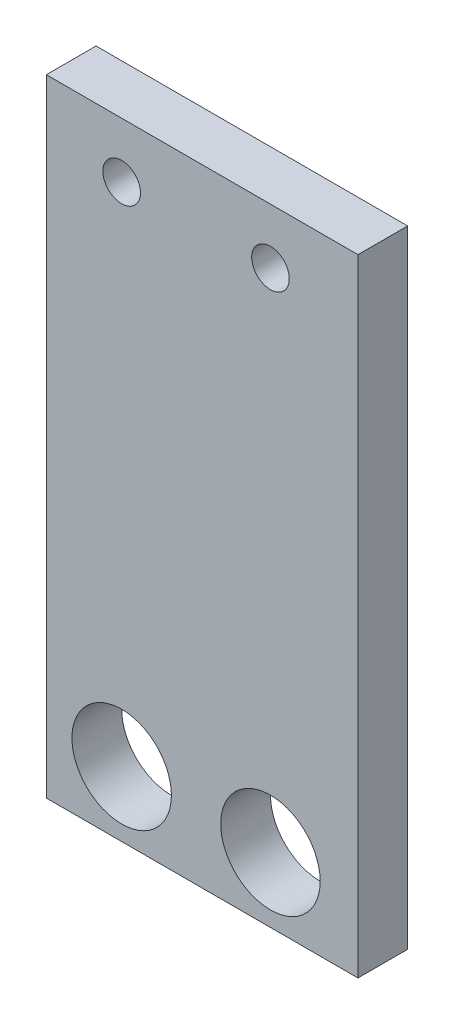
ISO-10303-21;
HEADER;
FILE_DESCRIPTION(('STEP AP214'),'2;1');
FILE_NAME('part.step','',(''),(''),'','','');
FILE_SCHEMA(('AUTOMOTIVE_DESIGN { 1 0 10303 214 1 1 1 1 }'));
ENDSEC;
DATA;
#1=APPLICATION_CONTEXT('core data for automotive mechanical design processes');
#2=APPLICATION_PROTOCOL_DEFINITION('international standard','automotive_design',2000,#1);
#3=PRODUCT_CONTEXT('',#1,'mechanical');
#4=PRODUCT('Part','Part','',(#3));
#5=PRODUCT_RELATED_PRODUCT_CATEGORY('part','',(#4));
#6=PRODUCT_DEFINITION_FORMATION('','',#4);
#7=PRODUCT_DEFINITION_CONTEXT('part definition',#1,'design');
#8=PRODUCT_DEFINITION('design','',#6,#7);
#9=PRODUCT_DEFINITION_SHAPE('','',#8);
#10=(LENGTH_UNIT() NAMED_UNIT(*) SI_UNIT(.MILLI.,.METRE.));
#11=(NAMED_UNIT(*) PLANE_ANGLE_UNIT() SI_UNIT($,.RADIAN.));
#12=(NAMED_UNIT(*) SI_UNIT($,.STERADIAN.) SOLID_ANGLE_UNIT());
#13=UNCERTAINTY_MEASURE_WITH_UNIT(LENGTH_MEASURE(1.E-05),#10,'distance_accuracy_value','');
#14=(GEOMETRIC_REPRESENTATION_CONTEXT(3) GLOBAL_UNCERTAINTY_ASSIGNED_CONTEXT((#13)) GLOBAL_UNIT_ASSIGNED_CONTEXT((#10,
#11,#12)) REPRESENTATION_CONTEXT('',''));
#15=CARTESIAN_POINT('',(0.,0.,0.));
#16=DIRECTION('',(0.,0.,1.));
#17=DIRECTION('',(1.,0.,0.));
#18=AXIS2_PLACEMENT_3D('',#15,#16,#17);
#19=CARTESIAN_POINT('',(0.,0.,3.175));
#20=DIRECTION('',(0.,0.,1.));
#21=DIRECTION('',(1.,0.,0.));
#22=AXIS2_PLACEMENT_3D('',#19,#20,#21);
#23=PLANE('',#22);
#24=CARTESIAN_POINT('',(-4.23397186213208,-20.1517609435873,3.175));
#25=DIRECTION('',(0.,0.,1.));
#26=DIRECTION('',(1.,0.,0.));
#27=AXIS2_PLACEMENT_3D('',#24,#25,#26);
#28=CIRCLE('',#27,3.175);
#29=CARTESIAN_POINT('',(-1.05897186213208,-20.1517609435873,3.175));
#30=VERTEX_POINT('',#29);
#31=EDGE_CURVE('E146',#30,#30,#28,.T.);
#32=ORIENTED_EDGE('',*,*,#31,.F.);
#33=EDGE_LOOP('',(#32));
#34=FACE_BOUND('',#33,.T.);
#35=CARTESIAN_POINT('',(-4.23397186213208,12.1721041198063,3.175));
#36=DIRECTION('',(0.,0.,1.));
#37=DIRECTION('',(1.,0.,0.));
#38=AXIS2_PLACEMENT_3D('',#35,#36,#37);
#39=CIRCLE('',#38,1.2);
#40=CARTESIAN_POINT('',(-3.03397186213208,12.1721041198063,3.175));
#41=VERTEX_POINT('',#40);
#42=EDGE_CURVE('E116',#41,#41,#39,.T.);
#43=ORIENTED_EDGE('',*,*,#42,.F.);
#44=EDGE_LOOP('',(#43));
#45=FACE_BOUND('',#44,.T.);
#46=DIRECTION('',(0.,-1.,0.));
#47=VECTOR('',#46,1.);
#48=CARTESIAN_POINT('',(-9.04597186213208,15.7037616287937,3.175));
#49=LINE('',#48,#47);
#50=CARTESIAN_POINT('',(-9.04597186213208,15.7037616287937,3.175));
#51=VERTEX_POINT('',#50);
#52=CARTESIAN_POINT('',(-9.04597186213208,-24.2962383712063,3.175));
#53=VERTEX_POINT('',#52);
#54=EDGE_CURVE('E96',#51,#53,#49,.T.);
#55=ORIENTED_EDGE('',*,*,#54,.T.);
#56=DIRECTION('',(1.,0.,0.));
#57=VECTOR('',#56,1.);
#58=CARTESIAN_POINT('',(-9.04597186213208,-24.2962383712063,3.175));
#59=LINE('',#58,#57);
#60=CARTESIAN_POINT('',(10.8540281378679,-24.2962383712063,3.175));
#61=VERTEX_POINT('',#60);
#62=EDGE_CURVE('E91',#53,#61,#59,.T.);
#63=ORIENTED_EDGE('',*,*,#62,.T.);
#64=DIRECTION('',(0.,1.,0.));
#65=VECTOR('',#64,1.);
#66=CARTESIAN_POINT('',(10.8540281378679,15.7037616287937,3.175));
#67=LINE('',#66,#65);
#68=CARTESIAN_POINT('',(10.8540281378679,15.7037616287937,3.175));
#69=VERTEX_POINT('',#68);
#70=EDGE_CURVE('E94',#61,#69,#67,.T.);
#71=ORIENTED_EDGE('',*,*,#70,.T.);
#72=DIRECTION('',(-1.,0.,0.));
#73=VECTOR('',#72,1.);
#74=CARTESIAN_POINT('',(-9.04597186213208,15.7037616287937,3.175));
#75=LINE('',#74,#73);
#76=EDGE_CURVE('E61',#69,#51,#75,.T.);
#77=ORIENTED_EDGE('',*,*,#76,.T.);
#78=EDGE_LOOP('',(#55,#63,#71,#77));
#79=FACE_BOUND('',#78,.T.);
#80=CARTESIAN_POINT('',(5.26602813786792,12.1721041198063,3.175));
#81=DIRECTION('',(0.,0.,1.));
#82=DIRECTION('',(1.,0.,0.));
#83=AXIS2_PLACEMENT_3D('',#80,#81,#82);
#84=CIRCLE('',#83,1.2);
#85=CARTESIAN_POINT('',(6.46602813786792,12.1721041198063,3.175));
#86=VERTEX_POINT('',#85);
#87=EDGE_CURVE('E138',#86,#86,#84,.T.);
#88=ORIENTED_EDGE('',*,*,#87,.F.);
#89=EDGE_LOOP('',(#88));
#90=FACE_BOUND('',#89,.T.);
#91=CARTESIAN_POINT('',(5.26602813786792,-20.1517609435873,3.175));
#92=DIRECTION('',(0.,0.,1.));
#93=DIRECTION('',(1.,0.,0.));
#94=AXIS2_PLACEMENT_3D('',#91,#92,#93);
#95=CIRCLE('',#94,3.175);
#96=CARTESIAN_POINT('',(8.44102813786792,-20.1517609435873,3.175));
#97=VERTEX_POINT('',#96);
#98=EDGE_CURVE('E154',#97,#97,#95,.T.);
#99=ORIENTED_EDGE('',*,*,#98,.F.);
#100=EDGE_LOOP('',(#99));
#101=FACE_BOUND('',#100,.T.);
#102=ADVANCED_FACE('F43',(#34,#45,#79,#90,#101),#23,.T.);
#103=CARTESIAN_POINT('',(0.,0.,0.));
#104=DIRECTION('',(0.,0.,1.));
#105=DIRECTION('',(1.,0.,0.));
#106=AXIS2_PLACEMENT_3D('',#103,#104,#105);
#107=PLANE('',#106);
#108=DIRECTION('',(0.,-1.,0.));
#109=VECTOR('',#108,1.);
#110=CARTESIAN_POINT('',(-9.04597186213208,15.7037616287937,0.));
#111=LINE('',#110,#109);
#112=CARTESIAN_POINT('',(-9.04597186213208,15.7037616287937,0.));
#113=VERTEX_POINT('',#112);
#114=CARTESIAN_POINT('',(-9.04597186213208,-24.2962383712063,0.));
#115=VERTEX_POINT('',#114);
#116=EDGE_CURVE('E112',#113,#115,#111,.T.);
#117=ORIENTED_EDGE('',*,*,#116,.F.);
#118=DIRECTION('',(-1.,0.,0.));
#119=VECTOR('',#118,1.);
#120=CARTESIAN_POINT('',(-9.04597186213208,15.7037616287937,0.));
#121=LINE('',#120,#119);
#122=CARTESIAN_POINT('',(10.8540281378679,15.7037616287937,0.));
#123=VERTEX_POINT('',#122);
#124=EDGE_CURVE('E84',#123,#113,#121,.T.);
#125=ORIENTED_EDGE('',*,*,#124,.F.);
#126=DIRECTION('',(0.,1.,0.));
#127=VECTOR('',#126,1.);
#128=CARTESIAN_POINT('',(10.8540281378679,15.7037616287937,0.));
#129=LINE('',#128,#127);
#130=CARTESIAN_POINT('',(10.8540281378679,-24.2962383712063,0.));
#131=VERTEX_POINT('',#130);
#132=EDGE_CURVE('E78',#131,#123,#129,.T.);
#133=ORIENTED_EDGE('',*,*,#132,.F.);
#134=DIRECTION('',(1.,0.,0.));
#135=VECTOR('',#134,1.);
#136=CARTESIAN_POINT('',(-9.04597186213208,-24.2962383712063,0.));
#137=LINE('',#136,#135);
#138=EDGE_CURVE('E101',#115,#131,#137,.T.);
#139=ORIENTED_EDGE('',*,*,#138,.F.);
#140=EDGE_LOOP('',(#117,#125,#133,#139));
#141=FACE_BOUND('',#140,.T.);
#142=CARTESIAN_POINT('',(-4.23397186213208,12.1721041198063,0.));
#143=DIRECTION('',(0.,0.,1.));
#144=DIRECTION('',(1.,0.,0.));
#145=AXIS2_PLACEMENT_3D('',#142,#143,#144);
#146=CIRCLE('',#145,1.2);
#147=CARTESIAN_POINT('',(-3.03397186213208,12.1721041198063,0.));
#148=VERTEX_POINT('',#147);
#149=EDGE_CURVE('E134',#148,#148,#146,.T.);
#150=ORIENTED_EDGE('',*,*,#149,.T.);
#151=EDGE_LOOP('',(#150));
#152=FACE_BOUND('',#151,.T.);
#153=CARTESIAN_POINT('',(5.26602813786792,12.1721041198063,0.));
#154=DIRECTION('',(0.,0.,1.));
#155=DIRECTION('',(1.,0.,0.));
#156=AXIS2_PLACEMENT_3D('',#153,#154,#155);
#157=CIRCLE('',#156,1.2);
#158=CARTESIAN_POINT('',(6.46602813786792,12.1721041198063,0.));
#159=VERTEX_POINT('',#158);
#160=EDGE_CURVE('E142',#159,#159,#157,.T.);
#161=ORIENTED_EDGE('',*,*,#160,.T.);
#162=EDGE_LOOP('',(#161));
#163=FACE_BOUND('',#162,.T.);
#164=CARTESIAN_POINT('',(-4.23397186213208,-20.1517609435873,0.));
#165=DIRECTION('',(0.,0.,1.));
#166=DIRECTION('',(1.,0.,0.));
#167=AXIS2_PLACEMENT_3D('',#164,#165,#166);
#168=CIRCLE('',#167,3.175);
#169=CARTESIAN_POINT('',(-1.05897186213208,-20.1517609435873,0.));
#170=VERTEX_POINT('',#169);
#171=EDGE_CURVE('E150',#170,#170,#168,.T.);
#172=ORIENTED_EDGE('',*,*,#171,.T.);
#173=EDGE_LOOP('',(#172));
#174=FACE_BOUND('',#173,.T.);
#175=CARTESIAN_POINT('',(5.26602813786792,-20.1517609435873,0.));
#176=DIRECTION('',(0.,0.,1.));
#177=DIRECTION('',(1.,0.,0.));
#178=AXIS2_PLACEMENT_3D('',#175,#176,#177);
#179=CIRCLE('',#178,3.175);
#180=CARTESIAN_POINT('',(8.44102813786792,-20.1517609435873,0.));
#181=VERTEX_POINT('',#180);
#182=EDGE_CURVE('E158',#181,#181,#179,.T.);
#183=ORIENTED_EDGE('',*,*,#182,.T.);
#184=EDGE_LOOP('',(#183));
#185=FACE_BOUND('',#184,.T.);
#186=ADVANCED_FACE('F129',(#141,#152,#163,#174,#185),#107,.F.);
#187=CARTESIAN_POINT('',(-9.04597186213208,15.7037616287937,3.175));
#188=DIRECTION('',(1.,0.,0.));
#189=DIRECTION('',(0.,1.,0.));
#190=AXIS2_PLACEMENT_3D('',#187,#188,#189);
#191=PLANE('',#190);
#192=ORIENTED_EDGE('',*,*,#116,.T.);
#193=DIRECTION('',(0.,0.,-1.));
#194=VECTOR('',#193,1.);
#195=CARTESIAN_POINT('',(-9.04597186213208,-24.2962383712063,3.175));
#196=LINE('',#195,#194);
#197=EDGE_CURVE('E11',#53,#115,#196,.T.);
#198=ORIENTED_EDGE('',*,*,#197,.F.);
#199=ORIENTED_EDGE('',*,*,#54,.F.);
#200=DIRECTION('',(0.,0.,-1.));
#201=VECTOR('',#200,1.);
#202=CARTESIAN_POINT('',(-9.04597186213208,15.7037616287937,3.175));
#203=LINE('',#202,#201);
#204=EDGE_CURVE('E108',#51,#113,#203,.T.);
#205=ORIENTED_EDGE('',*,*,#204,.T.);
#206=EDGE_LOOP('',(#192,#198,#199,#205));
#207=FACE_BOUND('',#206,.T.);
#208=ADVANCED_FACE('F45',(#207),#191,.F.);
#209=CARTESIAN_POINT('',(-9.04597186213208,-24.2962383712063,3.175));
#210=DIRECTION('',(0.,1.,0.));
#211=DIRECTION('',(0.,0.,1.));
#212=AXIS2_PLACEMENT_3D('',#209,#210,#211);
#213=PLANE('',#212);
#214=ORIENTED_EDGE('',*,*,#138,.T.);
#215=DIRECTION('',(0.,0.,-1.));
#216=VECTOR('',#215,1.);
#217=CARTESIAN_POINT('',(10.8540281378679,-24.2962383712063,3.175));
#218=LINE('',#217,#216);
#219=EDGE_CURVE('E53',#61,#131,#218,.T.);
#220=ORIENTED_EDGE('',*,*,#219,.F.);
#221=ORIENTED_EDGE('',*,*,#62,.F.);
#222=ORIENTED_EDGE('',*,*,#197,.T.);
#223=EDGE_LOOP('',(#214,#220,#221,#222));
#224=FACE_BOUND('',#223,.T.);
#225=ADVANCED_FACE('F100',(#224),#213,.F.);
#226=CARTESIAN_POINT('',(10.8540281378679,15.7037616287937,3.175));
#227=DIRECTION('',(-1.,0.,0.));
#228=DIRECTION('',(0.,-1.,0.));
#229=AXIS2_PLACEMENT_3D('',#226,#227,#228);
#230=PLANE('',#229);
#231=ORIENTED_EDGE('',*,*,#132,.T.);
#232=DIRECTION('',(0.,0.,-1.));
#233=VECTOR('',#232,1.);
#234=CARTESIAN_POINT('',(10.8540281378679,15.7037616287937,3.175));
#235=LINE('',#234,#233);
#236=EDGE_CURVE('E103',#69,#123,#235,.T.);
#237=ORIENTED_EDGE('',*,*,#236,.F.);
#238=ORIENTED_EDGE('',*,*,#70,.F.);
#239=ORIENTED_EDGE('',*,*,#219,.T.);
#240=EDGE_LOOP('',(#231,#237,#238,#239));
#241=FACE_BOUND('',#240,.T.);
#242=ADVANCED_FACE('F104',(#241),#230,.F.);
#243=CARTESIAN_POINT('',(-9.04597186213208,15.7037616287937,3.175));
#244=DIRECTION('',(0.,-1.,0.));
#245=DIRECTION('',(0.,0.,-1.));
#246=AXIS2_PLACEMENT_3D('',#243,#244,#245);
#247=PLANE('',#246);
#248=ORIENTED_EDGE('',*,*,#124,.T.);
#249=ORIENTED_EDGE('',*,*,#204,.F.);
#250=ORIENTED_EDGE('',*,*,#76,.F.);
#251=ORIENTED_EDGE('',*,*,#236,.T.);
#252=EDGE_LOOP('',(#248,#249,#250,#251));
#253=FACE_BOUND('',#252,.T.);
#254=ADVANCED_FACE('F126',(#253),#247,.F.);
#255=CARTESIAN_POINT('',(-4.23397186213208,12.1721041198063,3.175));
#256=DIRECTION('',(0.,0.,-1.));
#257=DIRECTION('',(-1.,0.,0.));
#258=AXIS2_PLACEMENT_3D('',#255,#256,#257);
#259=CYLINDRICAL_SURFACE('',#258,1.2);
#260=ORIENTED_EDGE('',*,*,#42,.T.);
#261=EDGE_LOOP('',(#260));
#262=FACE_BOUND('',#261,.T.);
#263=ORIENTED_EDGE('',*,*,#149,.F.);
#264=EDGE_LOOP('',(#263));
#265=FACE_BOUND('',#264,.T.);
#266=ADVANCED_FACE('F179',(#262,#265),#259,.F.);
#267=CARTESIAN_POINT('',(5.26602813786792,12.1721041198063,3.175));
#268=DIRECTION('',(0.,0.,-1.));
#269=DIRECTION('',(-1.,0.,0.));
#270=AXIS2_PLACEMENT_3D('',#267,#268,#269);
#271=CYLINDRICAL_SURFACE('',#270,1.2);
#272=ORIENTED_EDGE('',*,*,#87,.T.);
#273=EDGE_LOOP('',(#272));
#274=FACE_BOUND('',#273,.T.);
#275=ORIENTED_EDGE('',*,*,#160,.F.);
#276=EDGE_LOOP('',(#275));
#277=FACE_BOUND('',#276,.T.);
#278=ADVANCED_FACE('F233',(#274,#277),#271,.F.);
#279=CARTESIAN_POINT('',(-4.23397186213208,-20.1517609435873,3.175));
#280=DIRECTION('',(0.,0.,-1.));
#281=DIRECTION('',(-1.,0.,0.));
#282=AXIS2_PLACEMENT_3D('',#279,#280,#281);
#283=CYLINDRICAL_SURFACE('',#282,3.175);
#284=ORIENTED_EDGE('',*,*,#31,.T.);
#285=EDGE_LOOP('',(#284));
#286=FACE_BOUND('',#285,.T.);
#287=ORIENTED_EDGE('',*,*,#171,.F.);
#288=EDGE_LOOP('',(#287));
#289=FACE_BOUND('',#288,.T.);
#290=ADVANCED_FACE('F242',(#286,#289),#283,.F.);
#291=CARTESIAN_POINT('',(5.26602813786792,-20.1517609435873,3.175));
#292=DIRECTION('',(0.,0.,-1.));
#293=DIRECTION('',(-1.,0.,0.));
#294=AXIS2_PLACEMENT_3D('',#291,#292,#293);
#295=CYLINDRICAL_SURFACE('',#294,3.175);
#296=ORIENTED_EDGE('',*,*,#98,.T.);
#297=EDGE_LOOP('',(#296));
#298=FACE_BOUND('',#297,.T.);
#299=ORIENTED_EDGE('',*,*,#182,.F.);
#300=EDGE_LOOP('',(#299));
#301=FACE_BOUND('',#300,.T.);
#302=ADVANCED_FACE('F166',(#298,#301),#295,.F.);
#303=CLOSED_SHELL('',(#102,#186,#208,#225,#242,#254,#266,#278,#290,#302));
#304=MANIFOLD_SOLID_BREP('B2',#303);
#305=ADVANCED_BREP_SHAPE_REPRESENTATION('',(#18,#304),#14);
#306=SHAPE_DEFINITION_REPRESENTATION(#9,#305);
ENDSEC;
END-ISO-10303-21;
